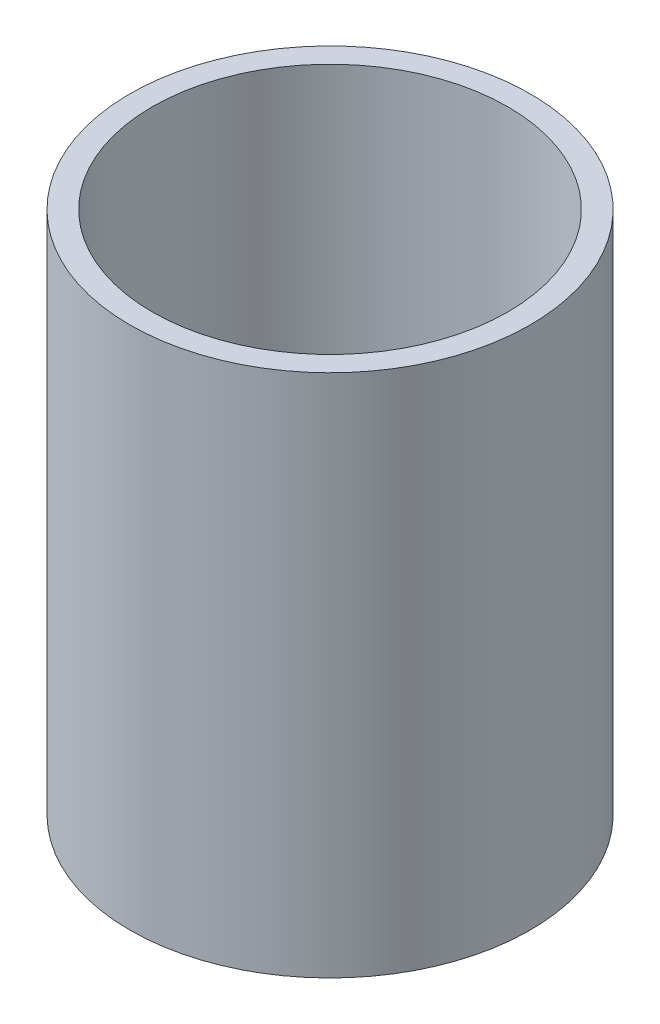
ISO-10303-21;
HEADER;
FILE_DESCRIPTION(('STEP AP214'),'2;1');
FILE_NAME('part.step','',(''),(''),'','','');
FILE_SCHEMA(('AUTOMOTIVE_DESIGN { 1 0 10303 214 1 1 1 1 }'));
ENDSEC;
DATA;
#1=APPLICATION_CONTEXT('core data for automotive mechanical design processes');
#2=APPLICATION_PROTOCOL_DEFINITION('international standard','automotive_design',2000,#1);
#3=PRODUCT_CONTEXT('',#1,'mechanical');
#4=PRODUCT('Part','Part','',(#3));
#5=PRODUCT_RELATED_PRODUCT_CATEGORY('part','',(#4));
#6=PRODUCT_DEFINITION_FORMATION('','',#4);
#7=PRODUCT_DEFINITION_CONTEXT('part definition',#1,'design');
#8=PRODUCT_DEFINITION('design','',#6,#7);
#9=PRODUCT_DEFINITION_SHAPE('','',#8);
#10=(LENGTH_UNIT() NAMED_UNIT(*) SI_UNIT(.MILLI.,.METRE.));
#11=(NAMED_UNIT(*) PLANE_ANGLE_UNIT() SI_UNIT($,.RADIAN.));
#12=(NAMED_UNIT(*) SI_UNIT($,.STERADIAN.) SOLID_ANGLE_UNIT());
#13=UNCERTAINTY_MEASURE_WITH_UNIT(LENGTH_MEASURE(1.E-05),#10,'distance_accuracy_value','');
#14=(GEOMETRIC_REPRESENTATION_CONTEXT(3) GLOBAL_UNCERTAINTY_ASSIGNED_CONTEXT((#13)) GLOBAL_UNIT_ASSIGNED_CONTEXT((#10,
#11,#12)) REPRESENTATION_CONTEXT('',''));
#15=CARTESIAN_POINT('',(0.,0.,0.));
#16=DIRECTION('',(0.,0.,1.));
#17=DIRECTION('',(1.,0.,0.));
#18=AXIS2_PLACEMENT_3D('',#15,#16,#17);
#19=CARTESIAN_POINT('',(0.,104.740645040097,0.));
#20=DIRECTION('',(0.,-1.,0.));
#21=DIRECTION('',(0.,0.,-1.));
#22=AXIS2_PLACEMENT_3D('',#19,#20,#21);
#23=CYLINDRICAL_SURFACE('',#22,40.);
#24=CARTESIAN_POINT('',(0.,104.740645040097,0.));
#25=DIRECTION('',(0.,1.,0.));
#26=DIRECTION('',(0.,0.,1.));
#27=AXIS2_PLACEMENT_3D('',#24,#25,#26);
#28=CIRCLE('',#27,40.);
#29=CARTESIAN_POINT('',(0.,104.740645040097,40.));
#30=VERTEX_POINT('',#29);
#31=EDGE_CURVE('E10',#30,#30,#28,.T.);
#32=ORIENTED_EDGE('',*,*,#31,.F.);
#33=EDGE_LOOP('',(#32));
#34=FACE_BOUND('',#33,.T.);
#35=CARTESIAN_POINT('',(0.,0.,0.));
#36=DIRECTION('',(0.,1.,0.));
#37=DIRECTION('',(0.,0.,1.));
#38=AXIS2_PLACEMENT_3D('',#35,#36,#37);
#39=CIRCLE('',#38,40.);
#40=CARTESIAN_POINT('',(0.,0.,40.));
#41=VERTEX_POINT('',#40);
#42=EDGE_CURVE('E37',#41,#41,#39,.T.);
#43=ORIENTED_EDGE('',*,*,#42,.T.);
#44=EDGE_LOOP('',(#43));
#45=FACE_BOUND('',#44,.T.);
#46=ADVANCED_FACE('F40',(#34,#45),#23,.T.);
#47=CARTESIAN_POINT('',(0.,104.740645040097,0.));
#48=DIRECTION('',(0.,1.,0.));
#49=DIRECTION('',(0.,0.,1.));
#50=AXIS2_PLACEMENT_3D('',#47,#48,#49);
#51=PLANE('',#50);
#52=CARTESIAN_POINT('',(0.,104.740645040097,0.));
#53=DIRECTION('',(0.,1.,0.));
#54=DIRECTION('',(0.,0.,1.));
#55=AXIS2_PLACEMENT_3D('',#52,#53,#54);
#56=CIRCLE('',#55,35.5256503529334);
#57=CARTESIAN_POINT('',(0.,104.740645040097,35.5256503529334));
#58=VERTEX_POINT('',#57);
#59=EDGE_CURVE('E50',#58,#58,#56,.T.);
#60=ORIENTED_EDGE('',*,*,#59,.F.);
#61=EDGE_LOOP('',(#60));
#62=FACE_BOUND('',#61,.T.);
#63=ORIENTED_EDGE('',*,*,#31,.T.);
#64=EDGE_LOOP('',(#63));
#65=FACE_BOUND('',#64,.T.);
#66=ADVANCED_FACE('F59',(#62,#65),#51,.T.);
#67=CARTESIAN_POINT('',(0.,0.,0.));
#68=DIRECTION('',(0.,1.,0.));
#69=DIRECTION('',(0.,0.,1.));
#70=AXIS2_PLACEMENT_3D('',#67,#68,#69);
#71=PLANE('',#70);
#72=CARTESIAN_POINT('',(0.,0.,0.));
#73=DIRECTION('',(0.,1.,0.));
#74=DIRECTION('',(0.,0.,1.));
#75=AXIS2_PLACEMENT_3D('',#72,#73,#74);
#76=CIRCLE('',#75,35.5256503529334);
#77=CARTESIAN_POINT('',(0.,0.,35.5256503529334));
#78=VERTEX_POINT('',#77);
#79=EDGE_CURVE('E47',#78,#78,#76,.T.);
#80=ORIENTED_EDGE('',*,*,#79,.T.);
#81=EDGE_LOOP('',(#80));
#82=FACE_BOUND('',#81,.T.);
#83=ORIENTED_EDGE('',*,*,#42,.F.);
#84=EDGE_LOOP('',(#83));
#85=FACE_BOUND('',#84,.T.);
#86=ADVANCED_FACE('F58',(#82,#85),#71,.F.);
#87=CARTESIAN_POINT('',(0.,104.740645040097,0.));
#88=DIRECTION('',(0.,-1.,0.));
#89=DIRECTION('',(0.,0.,-1.));
#90=AXIS2_PLACEMENT_3D('',#87,#88,#89);
#91=CYLINDRICAL_SURFACE('',#90,35.5256503529334);
#92=ORIENTED_EDGE('',*,*,#59,.T.);
#93=EDGE_LOOP('',(#92));
#94=FACE_BOUND('',#93,.T.);
#95=ORIENTED_EDGE('',*,*,#79,.F.);
#96=EDGE_LOOP('',(#95));
#97=FACE_BOUND('',#96,.T.);
#98=ADVANCED_FACE('F54',(#94,#97),#91,.F.);
#99=CLOSED_SHELL('',(#46,#66,#86,#98));
#100=MANIFOLD_SOLID_BREP('B2',#99);
#101=ADVANCED_BREP_SHAPE_REPRESENTATION('',(#18,#100),#14);
#102=SHAPE_DEFINITION_REPRESENTATION(#9,#101);
ENDSEC;
END-ISO-10303-21;
